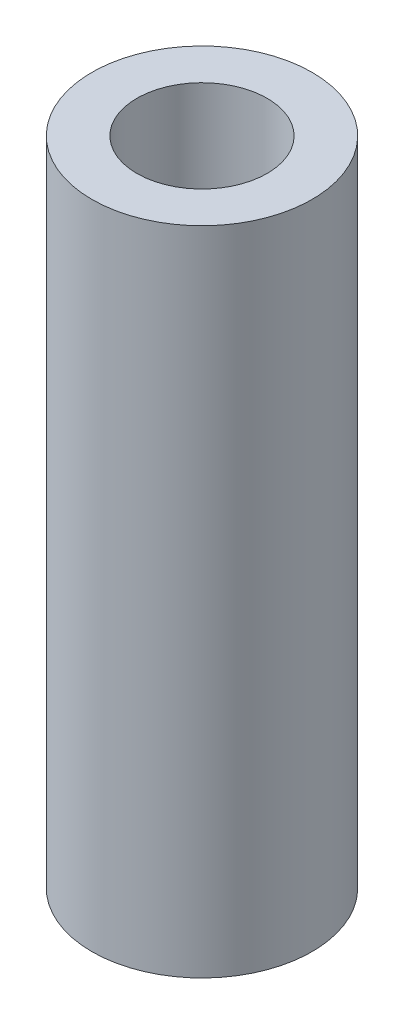
ISO-10303-21;
HEADER;
FILE_DESCRIPTION(('STEP AP214'),'2;1');
FILE_NAME('part.step','',(''),(''),'','','');
FILE_SCHEMA(('AUTOMOTIVE_DESIGN { 1 0 10303 214 1 1 1 1 }'));
ENDSEC;
DATA;
#1=APPLICATION_CONTEXT('core data for automotive mechanical design processes');
#2=APPLICATION_PROTOCOL_DEFINITION('international standard','automotive_design',2000,#1);
#3=PRODUCT_CONTEXT('',#1,'mechanical');
#4=PRODUCT('Part','Part','',(#3));
#5=PRODUCT_RELATED_PRODUCT_CATEGORY('part','',(#4));
#6=PRODUCT_DEFINITION_FORMATION('','',#4);
#7=PRODUCT_DEFINITION_CONTEXT('part definition',#1,'design');
#8=PRODUCT_DEFINITION('design','',#6,#7);
#9=PRODUCT_DEFINITION_SHAPE('','',#8);
#10=(LENGTH_UNIT() NAMED_UNIT(*) SI_UNIT(.MILLI.,.METRE.));
#11=(NAMED_UNIT(*) PLANE_ANGLE_UNIT() SI_UNIT($,.RADIAN.));
#12=(NAMED_UNIT(*) SI_UNIT($,.STERADIAN.) SOLID_ANGLE_UNIT());
#13=UNCERTAINTY_MEASURE_WITH_UNIT(LENGTH_MEASURE(1.E-05),#10,'distance_accuracy_value','');
#14=(GEOMETRIC_REPRESENTATION_CONTEXT(3) GLOBAL_UNCERTAINTY_ASSIGNED_CONTEXT((#13)) GLOBAL_UNIT_ASSIGNED_CONTEXT((#10,
#11,#12)) REPRESENTATION_CONTEXT('',''));
#15=CARTESIAN_POINT('',(0.,0.,0.));
#16=DIRECTION('',(0.,0.,1.));
#17=DIRECTION('',(1.,0.,0.));
#18=AXIS2_PLACEMENT_3D('',#15,#16,#17);
#19=CARTESIAN_POINT('',(0.,31.75,0.));
#20=DIRECTION('',(0.,1.,0.));
#21=DIRECTION('',(0.,0.,1.));
#22=AXIS2_PLACEMENT_3D('',#19,#20,#21);
#23=PLANE('',#22);
#24=CARTESIAN_POINT('',(0.,31.75,0.));
#25=DIRECTION('',(0.,1.,0.));
#26=DIRECTION('',(0.,0.,1.));
#27=AXIS2_PLACEMENT_3D('',#24,#25,#26);
#28=CIRCLE('',#27,10.7315);
#29=CARTESIAN_POINT('',(0.,31.75,10.7315));
#30=VERTEX_POINT('',#29);
#31=EDGE_CURVE('E11',#30,#30,#28,.T.);
#32=ORIENTED_EDGE('',*,*,#31,.T.);
#33=EDGE_LOOP('',(#32));
#34=FACE_BOUND('',#33,.T.);
#35=CARTESIAN_POINT('',(0.,31.75,0.));
#36=DIRECTION('',(0.,1.,0.));
#37=DIRECTION('',(0.,0.,1.));
#38=AXIS2_PLACEMENT_3D('',#35,#36,#37);
#39=CIRCLE('',#38,6.35);
#40=CARTESIAN_POINT('',(0.,31.75,6.35));
#41=VERTEX_POINT('',#40);
#42=EDGE_CURVE('E48',#41,#41,#39,.T.);
#43=ORIENTED_EDGE('',*,*,#42,.F.);
#44=EDGE_LOOP('',(#43));
#45=FACE_BOUND('',#44,.T.);
#46=ADVANCED_FACE('F37',(#34,#45),#23,.T.);
#47=CARTESIAN_POINT('',(0.,-31.75,0.));
#48=DIRECTION('',(0.,1.,0.));
#49=DIRECTION('',(0.,0.,1.));
#50=AXIS2_PLACEMENT_3D('',#47,#48,#49);
#51=PLANE('',#50);
#52=CARTESIAN_POINT('',(0.,-31.75,0.));
#53=DIRECTION('',(0.,1.,0.));
#54=DIRECTION('',(0.,0.,1.));
#55=AXIS2_PLACEMENT_3D('',#52,#53,#54);
#56=CIRCLE('',#55,10.7315);
#57=CARTESIAN_POINT('',(0.,-31.75,10.7315));
#58=VERTEX_POINT('',#57);
#59=EDGE_CURVE('E41',#58,#58,#56,.T.);
#60=ORIENTED_EDGE('',*,*,#59,.F.);
#61=EDGE_LOOP('',(#60));
#62=FACE_BOUND('',#61,.T.);
#63=CARTESIAN_POINT('',(0.,-31.75,0.));
#64=DIRECTION('',(0.,1.,0.));
#65=DIRECTION('',(0.,0.,1.));
#66=AXIS2_PLACEMENT_3D('',#63,#64,#65);
#67=CIRCLE('',#66,6.35);
#68=CARTESIAN_POINT('',(0.,-31.75,6.35));
#69=VERTEX_POINT('',#68);
#70=EDGE_CURVE('E50',#69,#69,#67,.T.);
#71=ORIENTED_EDGE('',*,*,#70,.T.);
#72=EDGE_LOOP('',(#71));
#73=FACE_BOUND('',#72,.T.);
#74=ADVANCED_FACE('F60',(#62,#73),#51,.F.);
#75=CARTESIAN_POINT('',(0.,31.75,0.));
#76=DIRECTION('',(0.,-1.,0.));
#77=DIRECTION('',(0.,0.,-1.));
#78=AXIS2_PLACEMENT_3D('',#75,#76,#77);
#79=CYLINDRICAL_SURFACE('',#78,10.7315);
#80=ORIENTED_EDGE('',*,*,#31,.F.);
#81=EDGE_LOOP('',(#80));
#82=FACE_BOUND('',#81,.T.);
#83=ORIENTED_EDGE('',*,*,#59,.T.);
#84=EDGE_LOOP('',(#83));
#85=FACE_BOUND('',#84,.T.);
#86=ADVANCED_FACE('F39',(#82,#85),#79,.T.);
#87=CARTESIAN_POINT('',(0.,31.75,0.));
#88=DIRECTION('',(0.,-1.,0.));
#89=DIRECTION('',(0.,0.,-1.));
#90=AXIS2_PLACEMENT_3D('',#87,#88,#89);
#91=CYLINDRICAL_SURFACE('',#90,6.35);
#92=ORIENTED_EDGE('',*,*,#42,.T.);
#93=EDGE_LOOP('',(#92));
#94=FACE_BOUND('',#93,.T.);
#95=ORIENTED_EDGE('',*,*,#70,.F.);
#96=EDGE_LOOP('',(#95));
#97=FACE_BOUND('',#96,.T.);
#98=ADVANCED_FACE('F56',(#94,#97),#91,.F.);
#99=CLOSED_SHELL('',(#46,#74,#86,#98));
#100=MANIFOLD_SOLID_BREP('B2',#99);
#101=ADVANCED_BREP_SHAPE_REPRESENTATION('',(#18,#100),#14);
#102=SHAPE_DEFINITION_REPRESENTATION(#9,#101);
ENDSEC;
END-ISO-10303-21;
